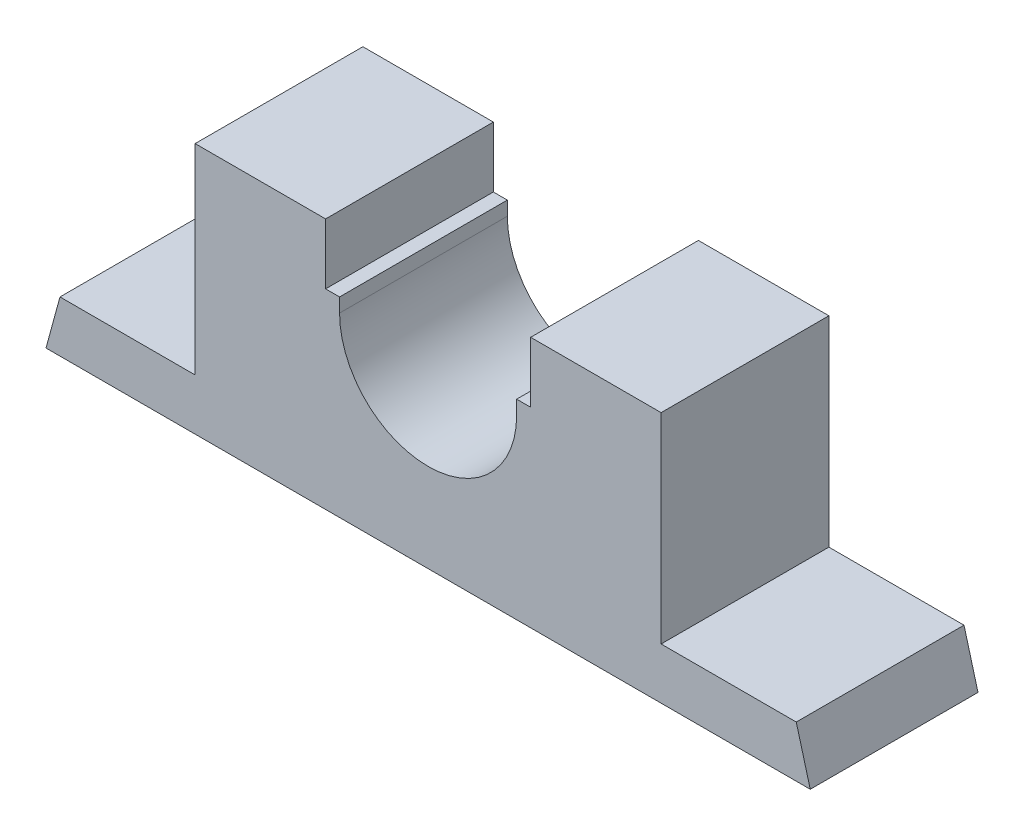
ISO-10303-21;
HEADER;
FILE_DESCRIPTION(('STEP AP214'),'2;1');
FILE_NAME('part.step','',(''),(''),'','','');
FILE_SCHEMA(('AUTOMOTIVE_DESIGN { 1 0 10303 214 1 1 1 1 }'));
ENDSEC;
DATA;
#1=APPLICATION_CONTEXT('core data for automotive mechanical design processes');
#2=APPLICATION_PROTOCOL_DEFINITION('international standard','automotive_design',2000,#1);
#3=PRODUCT_CONTEXT('',#1,'mechanical');
#4=PRODUCT('Part','Part','',(#3));
#5=PRODUCT_RELATED_PRODUCT_CATEGORY('part','',(#4));
#6=PRODUCT_DEFINITION_FORMATION('','',#4);
#7=PRODUCT_DEFINITION_CONTEXT('part definition',#1,'design');
#8=PRODUCT_DEFINITION('design','',#6,#7);
#9=PRODUCT_DEFINITION_SHAPE('','',#8);
#10=(LENGTH_UNIT() NAMED_UNIT(*) SI_UNIT(.MILLI.,.METRE.));
#11=(NAMED_UNIT(*) PLANE_ANGLE_UNIT() SI_UNIT($,.RADIAN.));
#12=(NAMED_UNIT(*) SI_UNIT($,.STERADIAN.) SOLID_ANGLE_UNIT());
#13=UNCERTAINTY_MEASURE_WITH_UNIT(LENGTH_MEASURE(1.E-05),#10,'distance_accuracy_value','');
#14=(GEOMETRIC_REPRESENTATION_CONTEXT(3) GLOBAL_UNCERTAINTY_ASSIGNED_CONTEXT((#13)) GLOBAL_UNIT_ASSIGNED_CONTEXT((#10,
#11,#12)) REPRESENTATION_CONTEXT('',''));
#15=CARTESIAN_POINT('',(0.,0.,0.));
#16=DIRECTION('',(0.,0.,1.));
#17=DIRECTION('',(1.,0.,0.));
#18=AXIS2_PLACEMENT_3D('',#15,#16,#17);
#19=CARTESIAN_POINT('',(79.,11.,36.));
#20=DIRECTION('',(-0.964763821237732,-0.263117405792109,0.));
#21=DIRECTION('',(0.263117405792109,-0.964763821237732,0.));
#22=AXIS2_PLACEMENT_3D('',#19,#20,#21);
#23=PLANE('',#22);
#24=DIRECTION('',(-0.263117405792109,0.964763821237732,0.));
#25=VECTOR('',#24,1.);
#26=CARTESIAN_POINT('',(79.,11.,0.));
#27=LINE('',#26,#25);
#28=CARTESIAN_POINT('',(82.,0.,0.));
#29=VERTEX_POINT('',#28);
#30=CARTESIAN_POINT('',(79.,11.,0.));
#31=VERTEX_POINT('',#30);
#32=EDGE_CURVE('E177',#29,#31,#27,.T.);
#33=ORIENTED_EDGE('',*,*,#32,.T.);
#34=DIRECTION('',(0.,0.,-1.));
#35=VECTOR('',#34,1.);
#36=CARTESIAN_POINT('',(79.,11.,36.));
#37=LINE('',#36,#35);
#38=CARTESIAN_POINT('',(79.,11.,36.));
#39=VERTEX_POINT('',#38);
#40=EDGE_CURVE('E11',#39,#31,#37,.T.);
#41=ORIENTED_EDGE('',*,*,#40,.F.);
#42=DIRECTION('',(-0.263117405792109,0.964763821237732,0.));
#43=VECTOR('',#42,1.);
#44=CARTESIAN_POINT('',(79.,11.,36.));
#45=LINE('',#44,#43);
#46=CARTESIAN_POINT('',(82.,0.,36.));
#47=VERTEX_POINT('',#46);
#48=EDGE_CURVE('E207',#47,#39,#45,.T.);
#49=ORIENTED_EDGE('',*,*,#48,.F.);
#50=DIRECTION('',(0.,0.,-1.));
#51=VECTOR('',#50,1.);
#52=CARTESIAN_POINT('',(82.,0.,36.));
#53=LINE('',#52,#51);
#54=EDGE_CURVE('E173',#47,#29,#53,.T.);
#55=ORIENTED_EDGE('',*,*,#54,.T.);
#56=EDGE_LOOP('',(#33,#41,#49,#55));
#57=FACE_BOUND('',#56,.T.);
#58=ADVANCED_FACE('F33',(#57),#23,.F.);
#59=CARTESIAN_POINT('',(79.,11.,36.));
#60=DIRECTION('',(0.,-1.,0.));
#61=DIRECTION('',(1.,0.,0.));
#62=AXIS2_PLACEMENT_3D('',#59,#60,#61);
#63=PLANE('',#62);
#64=DIRECTION('',(-1.,0.,0.));
#65=VECTOR('',#64,1.);
#66=CARTESIAN_POINT('',(79.,11.,0.));
#67=LINE('',#66,#65);
#68=CARTESIAN_POINT('',(50.,11.,0.));
#69=VERTEX_POINT('',#68);
#70=EDGE_CURVE('E180',#31,#69,#67,.T.);
#71=ORIENTED_EDGE('',*,*,#70,.T.);
#72=DIRECTION('',(0.,0.,-1.));
#73=VECTOR('',#72,1.);
#74=CARTESIAN_POINT('',(50.,11.,36.));
#75=LINE('',#74,#73);
#76=CARTESIAN_POINT('',(50.,11.,36.));
#77=VERTEX_POINT('',#76);
#78=EDGE_CURVE('E41',#77,#69,#75,.T.);
#79=ORIENTED_EDGE('',*,*,#78,.F.);
#80=DIRECTION('',(-1.,0.,0.));
#81=VECTOR('',#80,1.);
#82=CARTESIAN_POINT('',(79.,11.,36.));
#83=LINE('',#82,#81);
#84=EDGE_CURVE('E116',#39,#77,#83,.T.);
#85=ORIENTED_EDGE('',*,*,#84,.F.);
#86=ORIENTED_EDGE('',*,*,#40,.T.);
#87=EDGE_LOOP('',(#71,#79,#85,#86));
#88=FACE_BOUND('',#87,.T.);
#89=ADVANCED_FACE('F305',(#88),#63,.F.);
#90=CARTESIAN_POINT('',(50.,11.,36.));
#91=DIRECTION('',(-1.,0.,0.));
#92=DIRECTION('',(0.,0.,1.));
#93=AXIS2_PLACEMENT_3D('',#90,#91,#92);
#94=PLANE('',#93);
#95=DIRECTION('',(0.,1.,0.));
#96=VECTOR('',#95,1.);
#97=CARTESIAN_POINT('',(50.,11.,0.));
#98=LINE('',#97,#96);
#99=CARTESIAN_POINT('',(50.,54.,0.));
#100=VERTEX_POINT('',#99);
#101=EDGE_CURVE('E182',#69,#100,#98,.T.);
#102=ORIENTED_EDGE('',*,*,#101,.T.);
#103=DIRECTION('',(0.,0.,-1.));
#104=VECTOR('',#103,1.);
#105=CARTESIAN_POINT('',(50.,54.,36.));
#106=LINE('',#105,#104);
#107=CARTESIAN_POINT('',(50.,54.,36.));
#108=VERTEX_POINT('',#107);
#109=EDGE_CURVE('E238',#108,#100,#106,.T.);
#110=ORIENTED_EDGE('',*,*,#109,.F.);
#111=DIRECTION('',(0.,1.,0.));
#112=VECTOR('',#111,1.);
#113=CARTESIAN_POINT('',(50.,11.,36.));
#114=LINE('',#113,#112);
#115=EDGE_CURVE('E246',#77,#108,#114,.T.);
#116=ORIENTED_EDGE('',*,*,#115,.F.);
#117=ORIENTED_EDGE('',*,*,#78,.T.);
#118=EDGE_LOOP('',(#102,#110,#116,#117));
#119=FACE_BOUND('',#118,.T.);
#120=ADVANCED_FACE('F244',(#119),#94,.F.);
#121=CARTESIAN_POINT('',(50.,54.,36.));
#122=DIRECTION('',(0.,-1.,0.));
#123=DIRECTION('',(1.,0.,0.));
#124=AXIS2_PLACEMENT_3D('',#121,#122,#123);
#125=PLANE('',#124);
#126=DIRECTION('',(-1.,0.,0.));
#127=VECTOR('',#126,1.);
#128=CARTESIAN_POINT('',(50.,54.,0.));
#129=LINE('',#128,#127);
#130=CARTESIAN_POINT('',(22.,54.,0.));
#131=VERTEX_POINT('',#130);
#132=EDGE_CURVE('E184',#100,#131,#129,.T.);
#133=ORIENTED_EDGE('',*,*,#132,.T.);
#134=DIRECTION('',(0.,0.,-1.));
#135=VECTOR('',#134,1.);
#136=CARTESIAN_POINT('',(22.,54.,36.));
#137=LINE('',#136,#135);
#138=CARTESIAN_POINT('',(22.,54.,36.));
#139=VERTEX_POINT('',#138);
#140=EDGE_CURVE('E235',#139,#131,#137,.T.);
#141=ORIENTED_EDGE('',*,*,#140,.F.);
#142=DIRECTION('',(-1.,0.,0.));
#143=VECTOR('',#142,1.);
#144=CARTESIAN_POINT('',(50.,54.,36.));
#145=LINE('',#144,#143);
#146=EDGE_CURVE('E264',#108,#139,#145,.T.);
#147=ORIENTED_EDGE('',*,*,#146,.F.);
#148=ORIENTED_EDGE('',*,*,#109,.T.);
#149=EDGE_LOOP('',(#133,#141,#147,#148));
#150=FACE_BOUND('',#149,.T.);
#151=ADVANCED_FACE('F255',(#150),#125,.F.);
#152=CARTESIAN_POINT('',(22.,54.,36.));
#153=DIRECTION('',(1.,0.,0.));
#154=DIRECTION('',(0.,0.,-1.));
#155=AXIS2_PLACEMENT_3D('',#152,#153,#154);
#156=PLANE('',#155);
#157=DIRECTION('',(0.,-1.,0.));
#158=VECTOR('',#157,1.);
#159=CARTESIAN_POINT('',(22.,54.,0.));
#160=LINE('',#159,#158);
#161=CARTESIAN_POINT('',(22.,41.,0.));
#162=VERTEX_POINT('',#161);
#163=EDGE_CURVE('E186',#131,#162,#160,.T.);
#164=ORIENTED_EDGE('',*,*,#163,.T.);
#165=DIRECTION('',(0.,0.,-1.));
#166=VECTOR('',#165,1.);
#167=CARTESIAN_POINT('',(22.,41.,36.));
#168=LINE('',#167,#166);
#169=CARTESIAN_POINT('',(22.,41.,36.));
#170=VERTEX_POINT('',#169);
#171=EDGE_CURVE('E232',#170,#162,#168,.T.);
#172=ORIENTED_EDGE('',*,*,#171,.F.);
#173=DIRECTION('',(0.,-1.,0.));
#174=VECTOR('',#173,1.);
#175=CARTESIAN_POINT('',(22.,54.,36.));
#176=LINE('',#175,#174);
#177=EDGE_CURVE('E261',#139,#170,#176,.T.);
#178=ORIENTED_EDGE('',*,*,#177,.F.);
#179=ORIENTED_EDGE('',*,*,#140,.T.);
#180=EDGE_LOOP('',(#164,#172,#178,#179));
#181=FACE_BOUND('',#180,.T.);
#182=ADVANCED_FACE('F259',(#181),#156,.F.);
#183=CARTESIAN_POINT('',(22.,41.,36.));
#184=DIRECTION('',(0.,-1.,0.));
#185=DIRECTION('',(0.,0.,-1.));
#186=AXIS2_PLACEMENT_3D('',#183,#184,#185);
#187=PLANE('',#186);
#188=DIRECTION('',(-1.,0.,0.));
#189=VECTOR('',#188,1.);
#190=CARTESIAN_POINT('',(22.,41.,0.));
#191=LINE('',#190,#189);
#192=CARTESIAN_POINT('',(19.,41.,0.));
#193=VERTEX_POINT('',#192);
#194=EDGE_CURVE('E188',#162,#193,#191,.T.);
#195=ORIENTED_EDGE('',*,*,#194,.T.);
#196=DIRECTION('',(0.,0.,-1.));
#197=VECTOR('',#196,1.);
#198=CARTESIAN_POINT('',(19.,41.,36.));
#199=LINE('',#198,#197);
#200=CARTESIAN_POINT('',(19.,41.,36.));
#201=VERTEX_POINT('',#200);
#202=EDGE_CURVE('E229',#201,#193,#199,.T.);
#203=ORIENTED_EDGE('',*,*,#202,.F.);
#204=DIRECTION('',(-1.,0.,0.));
#205=VECTOR('',#204,1.);
#206=CARTESIAN_POINT('',(22.,41.,36.));
#207=LINE('',#206,#205);
#208=EDGE_CURVE('E263',#170,#201,#207,.T.);
#209=ORIENTED_EDGE('',*,*,#208,.F.);
#210=ORIENTED_EDGE('',*,*,#171,.T.);
#211=EDGE_LOOP('',(#195,#203,#209,#210));
#212=FACE_BOUND('',#211,.T.);
#213=ADVANCED_FACE('F318',(#212),#187,.F.);
#214=CARTESIAN_POINT('',(19.,41.,36.));
#215=DIRECTION('',(1.,0.,0.));
#216=DIRECTION('',(0.,0.,-1.));
#217=AXIS2_PLACEMENT_3D('',#214,#215,#216);
#218=PLANE('',#217);
#219=DIRECTION('',(0.,-1.,0.));
#220=VECTOR('',#219,1.);
#221=CARTESIAN_POINT('',(19.,41.,0.));
#222=LINE('',#221,#220);
#223=CARTESIAN_POINT('',(19.,38.,0.));
#224=VERTEX_POINT('',#223);
#225=EDGE_CURVE('E190',#193,#224,#222,.T.);
#226=ORIENTED_EDGE('',*,*,#225,.T.);
#227=DIRECTION('',(0.,0.,-1.));
#228=VECTOR('',#227,1.);
#229=CARTESIAN_POINT('',(19.,38.,36.));
#230=LINE('',#229,#228);
#231=CARTESIAN_POINT('',(19.,38.,36.));
#232=VERTEX_POINT('',#231);
#233=EDGE_CURVE('E226',#232,#224,#230,.T.);
#234=ORIENTED_EDGE('',*,*,#233,.F.);
#235=DIRECTION('',(0.,-1.,0.));
#236=VECTOR('',#235,1.);
#237=CARTESIAN_POINT('',(19.,41.,36.));
#238=LINE('',#237,#236);
#239=EDGE_CURVE('E266',#201,#232,#238,.T.);
#240=ORIENTED_EDGE('',*,*,#239,.F.);
#241=ORIENTED_EDGE('',*,*,#202,.T.);
#242=EDGE_LOOP('',(#226,#234,#240,#241));
#243=FACE_BOUND('',#242,.T.);
#244=ADVANCED_FACE('F321',(#243),#218,.F.);
#245=CARTESIAN_POINT('',(0.,38.,36.));
#246=DIRECTION('',(0.,0.,-1.));
#247=DIRECTION('',(-1.,0.,0.));
#248=AXIS2_PLACEMENT_3D('',#245,#246,#247);
#249=CYLINDRICAL_SURFACE('',#248,19.);
#250=CARTESIAN_POINT('',(0.,38.,0.));
#251=DIRECTION('',(0.,0.,-1.));
#252=DIRECTION('',(1.,0.,0.));
#253=AXIS2_PLACEMENT_3D('',#250,#251,#252);
#254=CIRCLE('',#253,19.);
#255=CARTESIAN_POINT('',(-19.,38.,0.));
#256=VERTEX_POINT('',#255);
#257=EDGE_CURVE('E192',#224,#256,#254,.T.);
#258=ORIENTED_EDGE('',*,*,#257,.T.);
#259=DIRECTION('',(0.,0.,-1.));
#260=VECTOR('',#259,1.);
#261=CARTESIAN_POINT('',(-19.,38.,36.));
#262=LINE('',#261,#260);
#263=CARTESIAN_POINT('',(-19.,38.,36.));
#264=VERTEX_POINT('',#263);
#265=EDGE_CURVE('E223',#264,#256,#262,.T.);
#266=ORIENTED_EDGE('',*,*,#265,.F.);
#267=CARTESIAN_POINT('',(0.,38.,36.));
#268=DIRECTION('',(0.,0.,-1.));
#269=DIRECTION('',(1.,0.,0.));
#270=AXIS2_PLACEMENT_3D('',#267,#268,#269);
#271=CIRCLE('',#270,19.);
#272=EDGE_CURVE('E272',#232,#264,#271,.T.);
#273=ORIENTED_EDGE('',*,*,#272,.F.);
#274=ORIENTED_EDGE('',*,*,#233,.T.);
#275=EDGE_LOOP('',(#258,#266,#273,#274));
#276=FACE_BOUND('',#275,.T.);
#277=ADVANCED_FACE('F325',(#276),#249,.F.);
#278=CARTESIAN_POINT('',(-19.,41.,36.));
#279=DIRECTION('',(-1.,0.,0.));
#280=DIRECTION('',(0.,0.,1.));
#281=AXIS2_PLACEMENT_3D('',#278,#279,#280);
#282=PLANE('',#281);
#283=DIRECTION('',(0.,1.,0.));
#284=VECTOR('',#283,1.);
#285=CARTESIAN_POINT('',(-19.,41.,0.));
#286=LINE('',#285,#284);
#287=CARTESIAN_POINT('',(-19.,41.,0.));
#288=VERTEX_POINT('',#287);
#289=EDGE_CURVE('E194',#256,#288,#286,.T.);
#290=ORIENTED_EDGE('',*,*,#289,.T.);
#291=DIRECTION('',(0.,0.,-1.));
#292=VECTOR('',#291,1.);
#293=CARTESIAN_POINT('',(-19.,41.,36.));
#294=LINE('',#293,#292);
#295=CARTESIAN_POINT('',(-19.,41.,36.));
#296=VERTEX_POINT('',#295);
#297=EDGE_CURVE('E220',#296,#288,#294,.T.);
#298=ORIENTED_EDGE('',*,*,#297,.F.);
#299=DIRECTION('',(0.,1.,0.));
#300=VECTOR('',#299,1.);
#301=CARTESIAN_POINT('',(-19.,41.,36.));
#302=LINE('',#301,#300);
#303=EDGE_CURVE('E274',#264,#296,#302,.T.);
#304=ORIENTED_EDGE('',*,*,#303,.F.);
#305=ORIENTED_EDGE('',*,*,#265,.T.);
#306=EDGE_LOOP('',(#290,#298,#304,#305));
#307=FACE_BOUND('',#306,.T.);
#308=ADVANCED_FACE('F329',(#307),#282,.F.);
#309=CARTESIAN_POINT('',(-22.,41.,36.));
#310=DIRECTION('',(0.,-1.,0.));
#311=DIRECTION('',(0.,0.,-1.));
#312=AXIS2_PLACEMENT_3D('',#309,#310,#311);
#313=PLANE('',#312);
#314=DIRECTION('',(-1.,0.,0.));
#315=VECTOR('',#314,1.);
#316=CARTESIAN_POINT('',(-22.,41.,0.));
#317=LINE('',#316,#315);
#318=CARTESIAN_POINT('',(-22.,41.,0.));
#319=VERTEX_POINT('',#318);
#320=EDGE_CURVE('E196',#288,#319,#317,.T.);
#321=ORIENTED_EDGE('',*,*,#320,.T.);
#322=DIRECTION('',(0.,0.,-1.));
#323=VECTOR('',#322,1.);
#324=CARTESIAN_POINT('',(-22.,41.,36.));
#325=LINE('',#324,#323);
#326=CARTESIAN_POINT('',(-22.,41.,36.));
#327=VERTEX_POINT('',#326);
#328=EDGE_CURVE('E217',#327,#319,#325,.T.);
#329=ORIENTED_EDGE('',*,*,#328,.F.);
#330=DIRECTION('',(-1.,0.,0.));
#331=VECTOR('',#330,1.);
#332=CARTESIAN_POINT('',(-22.,41.,36.));
#333=LINE('',#332,#331);
#334=EDGE_CURVE('E276',#296,#327,#333,.T.);
#335=ORIENTED_EDGE('',*,*,#334,.F.);
#336=ORIENTED_EDGE('',*,*,#297,.T.);
#337=EDGE_LOOP('',(#321,#329,#335,#336));
#338=FACE_BOUND('',#337,.T.);
#339=ADVANCED_FACE('F333',(#338),#313,.F.);
#340=CARTESIAN_POINT('',(-22.,54.,36.));
#341=DIRECTION('',(-1.,0.,0.));
#342=DIRECTION('',(0.,-1.,0.));
#343=AXIS2_PLACEMENT_3D('',#340,#341,#342);
#344=PLANE('',#343);
#345=DIRECTION('',(0.,1.,0.));
#346=VECTOR('',#345,1.);
#347=CARTESIAN_POINT('',(-22.,54.,0.));
#348=LINE('',#347,#346);
#349=CARTESIAN_POINT('',(-22.,54.,0.));
#350=VERTEX_POINT('',#349);
#351=EDGE_CURVE('E198',#319,#350,#348,.T.);
#352=ORIENTED_EDGE('',*,*,#351,.T.);
#353=DIRECTION('',(0.,0.,-1.));
#354=VECTOR('',#353,1.);
#355=CARTESIAN_POINT('',(-22.,54.,36.));
#356=LINE('',#355,#354);
#357=CARTESIAN_POINT('',(-22.,54.,36.));
#358=VERTEX_POINT('',#357);
#359=EDGE_CURVE('E214',#358,#350,#356,.T.);
#360=ORIENTED_EDGE('',*,*,#359,.F.);
#361=DIRECTION('',(0.,1.,0.));
#362=VECTOR('',#361,1.);
#363=CARTESIAN_POINT('',(-22.,54.,36.));
#364=LINE('',#363,#362);
#365=EDGE_CURVE('E278',#327,#358,#364,.T.);
#366=ORIENTED_EDGE('',*,*,#365,.F.);
#367=ORIENTED_EDGE('',*,*,#328,.T.);
#368=EDGE_LOOP('',(#352,#360,#366,#367));
#369=FACE_BOUND('',#368,.T.);
#370=ADVANCED_FACE('F337',(#369),#344,.F.);
#371=CARTESIAN_POINT('',(-50.,54.,36.));
#372=DIRECTION('',(0.,-1.,0.));
#373=DIRECTION('',(1.,0.,0.));
#374=AXIS2_PLACEMENT_3D('',#371,#372,#373);
#375=PLANE('',#374);
#376=DIRECTION('',(-1.,0.,0.));
#377=VECTOR('',#376,1.);
#378=CARTESIAN_POINT('',(-50.,54.,0.));
#379=LINE('',#378,#377);
#380=CARTESIAN_POINT('',(-50.,54.,0.));
#381=VERTEX_POINT('',#380);
#382=EDGE_CURVE('E200',#350,#381,#379,.T.);
#383=ORIENTED_EDGE('',*,*,#382,.T.);
#384=DIRECTION('',(0.,0.,-1.));
#385=VECTOR('',#384,1.);
#386=CARTESIAN_POINT('',(-50.,54.,36.));
#387=LINE('',#386,#385);
#388=CARTESIAN_POINT('',(-50.,54.,36.));
#389=VERTEX_POINT('',#388);
#390=EDGE_CURVE('E211',#389,#381,#387,.T.);
#391=ORIENTED_EDGE('',*,*,#390,.F.);
#392=DIRECTION('',(-1.,0.,0.));
#393=VECTOR('',#392,1.);
#394=CARTESIAN_POINT('',(-50.,54.,36.));
#395=LINE('',#394,#393);
#396=EDGE_CURVE('E280',#358,#389,#395,.T.);
#397=ORIENTED_EDGE('',*,*,#396,.F.);
#398=ORIENTED_EDGE('',*,*,#359,.T.);
#399=EDGE_LOOP('',(#383,#391,#397,#398));
#400=FACE_BOUND('',#399,.T.);
#401=ADVANCED_FACE('F286',(#400),#375,.F.);
#402=CARTESIAN_POINT('',(-50.,11.,36.));
#403=DIRECTION('',(1.,0.,0.));
#404=DIRECTION('',(0.,0.,-1.));
#405=AXIS2_PLACEMENT_3D('',#402,#403,#404);
#406=PLANE('',#405);
#407=DIRECTION('',(0.,-1.,0.));
#408=VECTOR('',#407,1.);
#409=CARTESIAN_POINT('',(-50.,11.,0.));
#410=LINE('',#409,#408);
#411=CARTESIAN_POINT('',(-50.,11.,0.));
#412=VERTEX_POINT('',#411);
#413=EDGE_CURVE('E202',#381,#412,#410,.T.);
#414=ORIENTED_EDGE('',*,*,#413,.T.);
#415=DIRECTION('',(0.,0.,-1.));
#416=VECTOR('',#415,1.);
#417=CARTESIAN_POINT('',(-50.,11.,36.));
#418=LINE('',#417,#416);
#419=CARTESIAN_POINT('',(-50.,11.,36.));
#420=VERTEX_POINT('',#419);
#421=EDGE_CURVE('E168',#420,#412,#418,.T.);
#422=ORIENTED_EDGE('',*,*,#421,.F.);
#423=DIRECTION('',(0.,-1.,0.));
#424=VECTOR('',#423,1.);
#425=CARTESIAN_POINT('',(-50.,11.,36.));
#426=LINE('',#425,#424);
#427=EDGE_CURVE('E159',#389,#420,#426,.T.);
#428=ORIENTED_EDGE('',*,*,#427,.F.);
#429=ORIENTED_EDGE('',*,*,#390,.T.);
#430=EDGE_LOOP('',(#414,#422,#428,#429));
#431=FACE_BOUND('',#430,.T.);
#432=ADVANCED_FACE('F290',(#431),#406,.F.);
#433=CARTESIAN_POINT('',(-79.,11.,36.));
#434=DIRECTION('',(0.,-1.,0.));
#435=DIRECTION('',(1.,0.,0.));
#436=AXIS2_PLACEMENT_3D('',#433,#434,#435);
#437=PLANE('',#436);
#438=DIRECTION('',(-1.,0.,0.));
#439=VECTOR('',#438,1.);
#440=CARTESIAN_POINT('',(-79.,11.,0.));
#441=LINE('',#440,#439);
#442=CARTESIAN_POINT('',(-79.,11.,0.));
#443=VERTEX_POINT('',#442);
#444=EDGE_CURVE('E167',#412,#443,#441,.T.);
#445=ORIENTED_EDGE('',*,*,#444,.T.);
#446=DIRECTION('',(0.,0.,-1.));
#447=VECTOR('',#446,1.);
#448=CARTESIAN_POINT('',(-79.,11.,36.));
#449=LINE('',#448,#447);
#450=CARTESIAN_POINT('',(-79.,11.,36.));
#451=VERTEX_POINT('',#450);
#452=EDGE_CURVE('E164',#451,#443,#449,.T.);
#453=ORIENTED_EDGE('',*,*,#452,.F.);
#454=DIRECTION('',(-1.,0.,0.));
#455=VECTOR('',#454,1.);
#456=CARTESIAN_POINT('',(-79.,11.,36.));
#457=LINE('',#456,#455);
#458=EDGE_CURVE('E153',#420,#451,#457,.T.);
#459=ORIENTED_EDGE('',*,*,#458,.F.);
#460=ORIENTED_EDGE('',*,*,#421,.T.);
#461=EDGE_LOOP('',(#445,#453,#459,#460));
#462=FACE_BOUND('',#461,.T.);
#463=ADVANCED_FACE('F165',(#462),#437,.F.);
#464=CARTESIAN_POINT('',(-79.,11.,36.));
#465=DIRECTION('',(0.964763821237732,-0.263117405792109,0.));
#466=DIRECTION('',(0.263117405792109,0.964763821237732,0.));
#467=AXIS2_PLACEMENT_3D('',#464,#465,#466);
#468=PLANE('',#467);
#469=DIRECTION('',(-0.263117405792109,-0.964763821237732,0.));
#470=VECTOR('',#469,1.);
#471=CARTESIAN_POINT('',(-79.,11.,0.));
#472=LINE('',#471,#470);
#473=CARTESIAN_POINT('',(-82.,0.,0.));
#474=VERTEX_POINT('',#473);
#475=EDGE_CURVE('E102',#443,#474,#472,.T.);
#476=ORIENTED_EDGE('',*,*,#475,.T.);
#477=DIRECTION('',(0.,0.,-1.));
#478=VECTOR('',#477,1.);
#479=CARTESIAN_POINT('',(-82.,0.,36.));
#480=LINE('',#479,#478);
#481=CARTESIAN_POINT('',(-82.,0.,36.));
#482=VERTEX_POINT('',#481);
#483=EDGE_CURVE('E169',#482,#474,#480,.T.);
#484=ORIENTED_EDGE('',*,*,#483,.F.);
#485=DIRECTION('',(-0.263117405792109,-0.964763821237732,0.));
#486=VECTOR('',#485,1.);
#487=CARTESIAN_POINT('',(-79.,11.,36.));
#488=LINE('',#487,#486);
#489=EDGE_CURVE('E157',#451,#482,#488,.T.);
#490=ORIENTED_EDGE('',*,*,#489,.F.);
#491=ORIENTED_EDGE('',*,*,#452,.T.);
#492=EDGE_LOOP('',(#476,#484,#490,#491));
#493=FACE_BOUND('',#492,.T.);
#494=ADVANCED_FACE('F171',(#493),#468,.F.);
#495=CARTESIAN_POINT('',(-82.,0.,36.));
#496=DIRECTION('',(0.,1.,0.));
#497=DIRECTION('',(0.,0.,1.));
#498=AXIS2_PLACEMENT_3D('',#495,#496,#497);
#499=PLANE('',#498);
#500=DIRECTION('',(1.,0.,0.));
#501=VECTOR('',#500,1.);
#502=CARTESIAN_POINT('',(-82.,0.,0.));
#503=LINE('',#502,#501);
#504=EDGE_CURVE('E108',#474,#29,#503,.T.);
#505=ORIENTED_EDGE('',*,*,#504,.T.);
#506=ORIENTED_EDGE('',*,*,#54,.F.);
#507=DIRECTION('',(1.,0.,0.));
#508=VECTOR('',#507,1.);
#509=CARTESIAN_POINT('',(-82.,0.,36.));
#510=LINE('',#509,#508);
#511=EDGE_CURVE('E49',#482,#47,#510,.T.);
#512=ORIENTED_EDGE('',*,*,#511,.F.);
#513=ORIENTED_EDGE('',*,*,#483,.T.);
#514=EDGE_LOOP('',(#505,#506,#512,#513));
#515=FACE_BOUND('',#514,.T.);
#516=ADVANCED_FACE('F294',(#515),#499,.F.);
#517=CARTESIAN_POINT('',(0.,38.,36.));
#518=DIRECTION('',(0.,0.,1.));
#519=DIRECTION('',(1.,0.,0.));
#520=AXIS2_PLACEMENT_3D('',#517,#518,#519);
#521=PLANE('',#520);
#522=ORIENTED_EDGE('',*,*,#48,.T.);
#523=ORIENTED_EDGE('',*,*,#84,.T.);
#524=ORIENTED_EDGE('',*,*,#115,.T.);
#525=ORIENTED_EDGE('',*,*,#146,.T.);
#526=ORIENTED_EDGE('',*,*,#177,.T.);
#527=ORIENTED_EDGE('',*,*,#208,.T.);
#528=ORIENTED_EDGE('',*,*,#239,.T.);
#529=ORIENTED_EDGE('',*,*,#272,.T.);
#530=ORIENTED_EDGE('',*,*,#303,.T.);
#531=ORIENTED_EDGE('',*,*,#334,.T.);
#532=ORIENTED_EDGE('',*,*,#365,.T.);
#533=ORIENTED_EDGE('',*,*,#396,.T.);
#534=ORIENTED_EDGE('',*,*,#427,.T.);
#535=ORIENTED_EDGE('',*,*,#458,.T.);
#536=ORIENTED_EDGE('',*,*,#489,.T.);
#537=ORIENTED_EDGE('',*,*,#511,.T.);
#538=EDGE_LOOP('',(#522,#523,#524,#525,#526,#527,#528,#529,#530,#531,#532,#533,#534,#535,#536,#537));
#539=FACE_BOUND('',#538,.T.);
#540=ADVANCED_FACE('F155',(#539),#521,.T.);
#541=CARTESIAN_POINT('',(0.,38.,0.));
#542=DIRECTION('',(0.,0.,1.));
#543=DIRECTION('',(1.,0.,0.));
#544=AXIS2_PLACEMENT_3D('',#541,#542,#543);
#545=PLANE('',#544);
#546=ORIENTED_EDGE('',*,*,#32,.F.);
#547=ORIENTED_EDGE('',*,*,#504,.F.);
#548=ORIENTED_EDGE('',*,*,#475,.F.);
#549=ORIENTED_EDGE('',*,*,#444,.F.);
#550=ORIENTED_EDGE('',*,*,#413,.F.);
#551=ORIENTED_EDGE('',*,*,#382,.F.);
#552=ORIENTED_EDGE('',*,*,#351,.F.);
#553=ORIENTED_EDGE('',*,*,#320,.F.);
#554=ORIENTED_EDGE('',*,*,#289,.F.);
#555=ORIENTED_EDGE('',*,*,#257,.F.);
#556=ORIENTED_EDGE('',*,*,#225,.F.);
#557=ORIENTED_EDGE('',*,*,#194,.F.);
#558=ORIENTED_EDGE('',*,*,#163,.F.);
#559=ORIENTED_EDGE('',*,*,#132,.F.);
#560=ORIENTED_EDGE('',*,*,#101,.F.);
#561=ORIENTED_EDGE('',*,*,#70,.F.);
#562=EDGE_LOOP('',(#546,#547,#548,#549,#550,#551,#552,#553,#554,#555,#556,#557,#558,#559,#560,#561));
#563=FACE_BOUND('',#562,.T.);
#564=ADVANCED_FACE('F250',(#563),#545,.F.);
#565=CLOSED_SHELL('',(#58,#89,#120,#151,#182,#213,#244,#277,#308,#339,#370,#401,#432,#463,#494,
#516,#540,#564));
#566=MANIFOLD_SOLID_BREP('B2',#565);
#567=ADVANCED_BREP_SHAPE_REPRESENTATION('',(#18,#566),#14);
#568=SHAPE_DEFINITION_REPRESENTATION(#9,#567);
ENDSEC;
END-ISO-10303-21;
